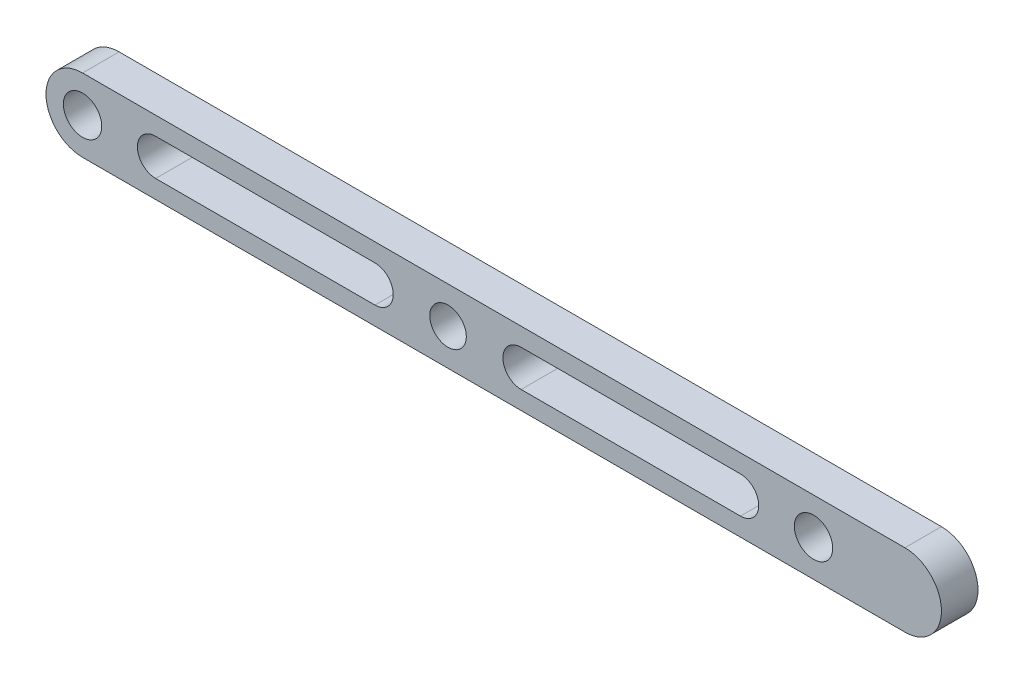
ISO-10303-21;
HEADER;
FILE_DESCRIPTION(('STEP AP214'),'2;1');
FILE_NAME('part.step','',(''),(''),'','','');
FILE_SCHEMA(('AUTOMOTIVE_DESIGN { 1 0 10303 214 1 1 1 1 }'));
ENDSEC;
DATA;
#1=APPLICATION_CONTEXT('core data for automotive mechanical design processes');
#2=APPLICATION_PROTOCOL_DEFINITION('international standard','automotive_design',2000,#1);
#3=PRODUCT_CONTEXT('',#1,'mechanical');
#4=PRODUCT('Part','Part','',(#3));
#5=PRODUCT_RELATED_PRODUCT_CATEGORY('part','',(#4));
#6=PRODUCT_DEFINITION_FORMATION('','',#4);
#7=PRODUCT_DEFINITION_CONTEXT('part definition',#1,'design');
#8=PRODUCT_DEFINITION('design','',#6,#7);
#9=PRODUCT_DEFINITION_SHAPE('','',#8);
#10=(LENGTH_UNIT() NAMED_UNIT(*) SI_UNIT(.MILLI.,.METRE.));
#11=(NAMED_UNIT(*) PLANE_ANGLE_UNIT() SI_UNIT($,.RADIAN.));
#12=(NAMED_UNIT(*) SI_UNIT($,.STERADIAN.) SOLID_ANGLE_UNIT());
#13=UNCERTAINTY_MEASURE_WITH_UNIT(LENGTH_MEASURE(1.E-05),#10,'distance_accuracy_value','');
#14=(GEOMETRIC_REPRESENTATION_CONTEXT(3) GLOBAL_UNCERTAINTY_ASSIGNED_CONTEXT((#13)) GLOBAL_UNIT_ASSIGNED_CONTEXT((#10,
#11,#12)) REPRESENTATION_CONTEXT('',''));
#15=CARTESIAN_POINT('',(0.,0.,0.));
#16=DIRECTION('',(0.,0.,1.));
#17=DIRECTION('',(1.,0.,0.));
#18=AXIS2_PLACEMENT_3D('',#15,#16,#17);
#19=CARTESIAN_POINT('',(124.999999999805,0.,10.));
#20=DIRECTION('',(0.,0.,1.));
#21=DIRECTION('',(1.,0.,0.));
#22=AXIS2_PLACEMENT_3D('',#19,#20,#21);
#23=PLANE('',#22);
#24=CARTESIAN_POINT('',(20.,0.,10.));
#25=DIRECTION('',(0.,0.,1.));
#26=DIRECTION('',(1.,0.,0.));
#27=AXIS2_PLACEMENT_3D('',#24,#25,#26);
#28=CIRCLE('',#27,5.);
#29=CARTESIAN_POINT('',(20.,5.,10.));
#30=VERTEX_POINT('',#29);
#31=CARTESIAN_POINT('',(20.,-5.,10.));
#32=VERTEX_POINT('',#31);
#33=EDGE_CURVE('E47',#30,#32,#28,.T.);
#34=ORIENTED_EDGE('',*,*,#33,.F.);
#35=DIRECTION('',(-1.,0.,0.));
#36=VECTOR('',#35,1.);
#37=CARTESIAN_POINT('',(20.,5.,10.));
#38=LINE('',#37,#36);
#39=CARTESIAN_POINT('',(79.999999999805,5.,10.));
#40=VERTEX_POINT('',#39);
#41=EDGE_CURVE('E139',#40,#30,#38,.T.);
#42=ORIENTED_EDGE('',*,*,#41,.F.);
#43=CARTESIAN_POINT('',(79.999999999805,0.,10.));
#44=DIRECTION('',(0.,0.,1.));
#45=DIRECTION('',(1.,0.,0.));
#46=AXIS2_PLACEMENT_3D('',#43,#44,#45);
#47=CIRCLE('',#46,5.);
#48=CARTESIAN_POINT('',(79.999999999805,-5.,10.));
#49=VERTEX_POINT('',#48);
#50=EDGE_CURVE('E142',#49,#40,#47,.T.);
#51=ORIENTED_EDGE('',*,*,#50,.F.);
#52=DIRECTION('',(1.,0.,0.));
#53=VECTOR('',#52,1.);
#54=CARTESIAN_POINT('',(20.,-5.,10.));
#55=LINE('',#54,#53);
#56=EDGE_CURVE('E148',#32,#49,#55,.T.);
#57=ORIENTED_EDGE('',*,*,#56,.F.);
#58=EDGE_LOOP('',(#34,#42,#51,#57));
#59=FACE_BOUND('',#58,.T.);
#60=CARTESIAN_POINT('',(-79.9999999999991,0.,10.));
#61=DIRECTION('',(0.,0.,1.));
#62=DIRECTION('',(1.,0.,0.));
#63=AXIS2_PLACEMENT_3D('',#60,#61,#62);
#64=CIRCLE('',#63,5.);
#65=CARTESIAN_POINT('',(-79.9999999999991,5.,10.));
#66=VERTEX_POINT('',#65);
#67=CARTESIAN_POINT('',(-79.9999999999991,-5.,10.));
#68=VERTEX_POINT('',#67);
#69=EDGE_CURVE('E154',#66,#68,#64,.T.);
#70=ORIENTED_EDGE('',*,*,#69,.F.);
#71=DIRECTION('',(-1.,0.,0.));
#72=VECTOR('',#71,1.);
#73=CARTESIAN_POINT('',(-79.9999999999991,5.,10.));
#74=LINE('',#73,#72);
#75=CARTESIAN_POINT('',(-20.,5.,10.));
#76=VERTEX_POINT('',#75);
#77=EDGE_CURVE('E162',#76,#66,#74,.T.);
#78=ORIENTED_EDGE('',*,*,#77,.F.);
#79=CARTESIAN_POINT('',(-20.,0.,10.));
#80=DIRECTION('',(0.,0.,1.));
#81=DIRECTION('',(1.,0.,0.));
#82=AXIS2_PLACEMENT_3D('',#79,#80,#81);
#83=CIRCLE('',#82,5.);
#84=CARTESIAN_POINT('',(-20.,-5.,10.));
#85=VERTEX_POINT('',#84);
#86=EDGE_CURVE('E176',#85,#76,#83,.T.);
#87=ORIENTED_EDGE('',*,*,#86,.F.);
#88=DIRECTION('',(1.,0.,0.));
#89=VECTOR('',#88,1.);
#90=CARTESIAN_POINT('',(-79.9999999999991,-5.,10.));
#91=LINE('',#90,#89);
#92=EDGE_CURVE('E173',#68,#85,#91,.T.);
#93=ORIENTED_EDGE('',*,*,#92,.F.);
#94=EDGE_LOOP('',(#70,#78,#87,#93));
#95=FACE_BOUND('',#94,.T.);
#96=CARTESIAN_POINT('',(0.,0.,10.));
#97=DIRECTION('',(0.,0.,1.));
#98=DIRECTION('',(1.,0.,0.));
#99=AXIS2_PLACEMENT_3D('',#96,#97,#98);
#100=CIRCLE('',#99,5.);
#101=CARTESIAN_POINT('',(5.,0.,10.));
#102=VERTEX_POINT('',#101);
#103=EDGE_CURVE('E183',#102,#102,#100,.T.);
#104=ORIENTED_EDGE('',*,*,#103,.F.);
#105=EDGE_LOOP('',(#104));
#106=FACE_BOUND('',#105,.T.);
#107=CARTESIAN_POINT('',(-99.9999999999991,0.,10.));
#108=DIRECTION('',(0.,0.,1.));
#109=DIRECTION('',(1.,0.,0.));
#110=AXIS2_PLACEMENT_3D('',#107,#108,#109);
#111=CIRCLE('',#110,5.25);
#112=CARTESIAN_POINT('',(-94.7499999999991,0.,10.));
#113=VERTEX_POINT('',#112);
#114=EDGE_CURVE('E202',#113,#113,#111,.T.);
#115=ORIENTED_EDGE('',*,*,#114,.F.);
#116=EDGE_LOOP('',(#115));
#117=FACE_BOUND('',#116,.T.);
#118=DIRECTION('',(1.,0.,0.));
#119=VECTOR('',#118,1.);
#120=CARTESIAN_POINT('',(99.999999999805,-10.,10.));
#121=LINE('',#120,#119);
#122=CARTESIAN_POINT('',(-99.9999999999991,-10.,10.));
#123=VERTEX_POINT('',#122);
#124=CARTESIAN_POINT('',(124.999999999805,-10.,10.));
#125=VERTEX_POINT('',#124);
#126=EDGE_CURVE('E208',#123,#125,#121,.T.);
#127=ORIENTED_EDGE('',*,*,#126,.T.);
#128=CARTESIAN_POINT('',(124.999999999805,0.,10.));
#129=DIRECTION('',(0.,0.,1.));
#130=DIRECTION('',(1.,0.,0.));
#131=AXIS2_PLACEMENT_3D('',#128,#129,#130);
#132=CIRCLE('',#131,10.);
#133=CARTESIAN_POINT('',(124.999999999805,10.,10.));
#134=VERTEX_POINT('',#133);
#135=EDGE_CURVE('E211',#125,#134,#132,.T.);
#136=ORIENTED_EDGE('',*,*,#135,.T.);
#137=DIRECTION('',(-1.,0.,0.));
#138=VECTOR('',#137,1.);
#139=CARTESIAN_POINT('',(100.000000000001,10.,10.));
#140=LINE('',#139,#138);
#141=CARTESIAN_POINT('',(-99.9999999999991,10.,10.));
#142=VERTEX_POINT('',#141);
#143=EDGE_CURVE('E214',#134,#142,#140,.T.);
#144=ORIENTED_EDGE('',*,*,#143,.T.);
#145=CARTESIAN_POINT('',(-99.9999999999991,0.,10.));
#146=DIRECTION('',(0.,0.,1.));
#147=DIRECTION('',(1.,0.,0.));
#148=AXIS2_PLACEMENT_3D('',#145,#146,#147);
#149=CIRCLE('',#148,10.);
#150=EDGE_CURVE('E216',#142,#123,#149,.T.);
#151=ORIENTED_EDGE('',*,*,#150,.T.);
#152=EDGE_LOOP('',(#127,#136,#144,#151));
#153=FACE_BOUND('',#152,.T.);
#154=CARTESIAN_POINT('',(99.999999999805,0.,10.));
#155=DIRECTION('',(0.,0.,1.));
#156=DIRECTION('',(1.,0.,0.));
#157=AXIS2_PLACEMENT_3D('',#154,#155,#156);
#158=CIRCLE('',#157,5.25);
#159=CARTESIAN_POINT('',(105.249999999805,0.,10.));
#160=VERTEX_POINT('',#159);
#161=EDGE_CURVE('E196',#160,#160,#158,.T.);
#162=ORIENTED_EDGE('',*,*,#161,.F.);
#163=EDGE_LOOP('',(#162));
#164=FACE_BOUND('',#163,.T.);
#165=ADVANCED_FACE('F32',(#59,#95,#106,#117,#153,#164),#23,.T.);
#166=CARTESIAN_POINT('',(124.999999999805,0.,0.));
#167=DIRECTION('',(0.,0.,1.));
#168=DIRECTION('',(1.,0.,0.));
#169=AXIS2_PLACEMENT_3D('',#166,#167,#168);
#170=PLANE('',#169);
#171=DIRECTION('',(-1.,0.,0.));
#172=VECTOR('',#171,1.);
#173=CARTESIAN_POINT('',(20.,5.,0.));
#174=LINE('',#173,#172);
#175=CARTESIAN_POINT('',(79.999999999805,5.,0.));
#176=VERTEX_POINT('',#175);
#177=CARTESIAN_POINT('',(20.,5.,0.));
#178=VERTEX_POINT('',#177);
#179=EDGE_CURVE('E129',#176,#178,#174,.T.);
#180=ORIENTED_EDGE('',*,*,#179,.T.);
#181=CARTESIAN_POINT('',(20.,0.,0.));
#182=DIRECTION('',(0.,0.,1.));
#183=DIRECTION('',(1.,0.,0.));
#184=AXIS2_PLACEMENT_3D('',#181,#182,#183);
#185=CIRCLE('',#184,5.);
#186=CARTESIAN_POINT('',(20.,-5.,0.));
#187=VERTEX_POINT('',#186);
#188=EDGE_CURVE('E123',#178,#187,#185,.T.);
#189=ORIENTED_EDGE('',*,*,#188,.T.);
#190=DIRECTION('',(1.,0.,0.));
#191=VECTOR('',#190,1.);
#192=CARTESIAN_POINT('',(20.,-5.,0.));
#193=LINE('',#192,#191);
#194=CARTESIAN_POINT('',(79.999999999805,-5.,0.));
#195=VERTEX_POINT('',#194);
#196=EDGE_CURVE('E132',#187,#195,#193,.T.);
#197=ORIENTED_EDGE('',*,*,#196,.T.);
#198=CARTESIAN_POINT('',(79.999999999805,0.,0.));
#199=DIRECTION('',(0.,0.,1.));
#200=DIRECTION('',(1.,0.,0.));
#201=AXIS2_PLACEMENT_3D('',#198,#199,#200);
#202=CIRCLE('',#201,5.);
#203=EDGE_CURVE('E55',#195,#176,#202,.T.);
#204=ORIENTED_EDGE('',*,*,#203,.T.);
#205=EDGE_LOOP('',(#180,#189,#197,#204));
#206=FACE_BOUND('',#205,.T.);
#207=DIRECTION('',(-1.,0.,0.));
#208=VECTOR('',#207,1.);
#209=CARTESIAN_POINT('',(-79.9999999999991,5.,0.));
#210=LINE('',#209,#208);
#211=CARTESIAN_POINT('',(-20.,5.,0.));
#212=VERTEX_POINT('',#211);
#213=CARTESIAN_POINT('',(-79.9999999999991,5.,0.));
#214=VERTEX_POINT('',#213);
#215=EDGE_CURVE('E168',#212,#214,#210,.T.);
#216=ORIENTED_EDGE('',*,*,#215,.T.);
#217=CARTESIAN_POINT('',(-79.9999999999991,0.,0.));
#218=DIRECTION('',(0.,0.,1.));
#219=DIRECTION('',(1.,0.,0.));
#220=AXIS2_PLACEMENT_3D('',#217,#218,#219);
#221=CIRCLE('',#220,5.);
#222=CARTESIAN_POINT('',(-79.9999999999991,-5.,0.));
#223=VERTEX_POINT('',#222);
#224=EDGE_CURVE('E158',#214,#223,#221,.T.);
#225=ORIENTED_EDGE('',*,*,#224,.T.);
#226=DIRECTION('',(1.,0.,0.));
#227=VECTOR('',#226,1.);
#228=CARTESIAN_POINT('',(-79.9999999999991,-5.,0.));
#229=LINE('',#228,#227);
#230=CARTESIAN_POINT('',(-20.,-5.,0.));
#231=VERTEX_POINT('',#230);
#232=EDGE_CURVE('E161',#223,#231,#229,.T.);
#233=ORIENTED_EDGE('',*,*,#232,.T.);
#234=CARTESIAN_POINT('',(-20.,0.,0.));
#235=DIRECTION('',(0.,0.,1.));
#236=DIRECTION('',(1.,0.,0.));
#237=AXIS2_PLACEMENT_3D('',#234,#235,#236);
#238=CIRCLE('',#237,5.);
#239=EDGE_CURVE('E165',#231,#212,#238,.T.);
#240=ORIENTED_EDGE('',*,*,#239,.T.);
#241=EDGE_LOOP('',(#216,#225,#233,#240));
#242=FACE_BOUND('',#241,.T.);
#243=CARTESIAN_POINT('',(0.,0.,0.));
#244=DIRECTION('',(0.,0.,1.));
#245=DIRECTION('',(1.,0.,0.));
#246=AXIS2_PLACEMENT_3D('',#243,#244,#245);
#247=CIRCLE('',#246,5.);
#248=CARTESIAN_POINT('',(5.,0.,0.));
#249=VERTEX_POINT('',#248);
#250=EDGE_CURVE('E190',#249,#249,#247,.T.);
#251=ORIENTED_EDGE('',*,*,#250,.T.);
#252=EDGE_LOOP('',(#251));
#253=FACE_BOUND('',#252,.T.);
#254=CARTESIAN_POINT('',(124.999999999805,0.,0.));
#255=DIRECTION('',(0.,0.,1.));
#256=DIRECTION('',(1.,0.,0.));
#257=AXIS2_PLACEMENT_3D('',#254,#255,#256);
#258=CIRCLE('',#257,10.);
#259=CARTESIAN_POINT('',(124.999999999805,-10.,0.));
#260=VERTEX_POINT('',#259);
#261=CARTESIAN_POINT('',(124.999999999805,10.,0.));
#262=VERTEX_POINT('',#261);
#263=EDGE_CURVE('E205',#260,#262,#258,.T.);
#264=ORIENTED_EDGE('',*,*,#263,.F.);
#265=DIRECTION('',(1.,0.,0.));
#266=VECTOR('',#265,1.);
#267=CARTESIAN_POINT('',(-99.9999999999991,-10.,0.));
#268=LINE('',#267,#266);
#269=CARTESIAN_POINT('',(-99.9999999999991,-10.,0.));
#270=VERTEX_POINT('',#269);
#271=EDGE_CURVE('E212',#270,#260,#268,.T.);
#272=ORIENTED_EDGE('',*,*,#271,.F.);
#273=CARTESIAN_POINT('',(-99.9999999999991,0.,0.));
#274=DIRECTION('',(0.,0.,1.));
#275=DIRECTION('',(1.,0.,0.));
#276=AXIS2_PLACEMENT_3D('',#273,#274,#275);
#277=CIRCLE('',#276,10.);
#278=CARTESIAN_POINT('',(-99.9999999999991,10.,0.));
#279=VERTEX_POINT('',#278);
#280=EDGE_CURVE('E224',#279,#270,#277,.T.);
#281=ORIENTED_EDGE('',*,*,#280,.F.);
#282=DIRECTION('',(-1.,0.,0.));
#283=VECTOR('',#282,1.);
#284=CARTESIAN_POINT('',(-99.9999999999991,10.,0.));
#285=LINE('',#284,#283);
#286=EDGE_CURVE('E222',#262,#279,#285,.T.);
#287=ORIENTED_EDGE('',*,*,#286,.F.);
#288=EDGE_LOOP('',(#264,#272,#281,#287));
#289=FACE_BOUND('',#288,.T.);
#290=CARTESIAN_POINT('',(-99.9999999999991,0.,0.));
#291=DIRECTION('',(0.,0.,1.));
#292=DIRECTION('',(1.,0.,0.));
#293=AXIS2_PLACEMENT_3D('',#290,#291,#292);
#294=CIRCLE('',#293,5.25);
#295=CARTESIAN_POINT('',(-94.7499999999991,0.,0.));
#296=VERTEX_POINT('',#295);
#297=EDGE_CURVE('E199',#296,#296,#294,.T.);
#298=ORIENTED_EDGE('',*,*,#297,.T.);
#299=EDGE_LOOP('',(#298));
#300=FACE_BOUND('',#299,.T.);
#301=CARTESIAN_POINT('',(99.999999999805,0.,0.));
#302=DIRECTION('',(0.,0.,1.));
#303=DIRECTION('',(1.,0.,0.));
#304=AXIS2_PLACEMENT_3D('',#301,#302,#303);
#305=CIRCLE('',#304,5.25);
#306=CARTESIAN_POINT('',(105.249999999805,0.,0.));
#307=VERTEX_POINT('',#306);
#308=EDGE_CURVE('E193',#307,#307,#305,.T.);
#309=ORIENTED_EDGE('',*,*,#308,.T.);
#310=EDGE_LOOP('',(#309));
#311=FACE_BOUND('',#310,.T.);
#312=ADVANCED_FACE('F136',(#206,#242,#253,#289,#300,#311),#170,.F.);
#313=CARTESIAN_POINT('',(124.999999999805,0.,10.));
#314=DIRECTION('',(0.,0.,-1.));
#315=DIRECTION('',(-1.,0.,0.));
#316=AXIS2_PLACEMENT_3D('',#313,#314,#315);
#317=CYLINDRICAL_SURFACE('',#316,10.);
#318=ORIENTED_EDGE('',*,*,#263,.T.);
#319=DIRECTION('',(0.,0.,-1.));
#320=VECTOR('',#319,1.);
#321=CARTESIAN_POINT('',(124.999999999805,10.,10.));
#322=LINE('',#321,#320);
#323=EDGE_CURVE('E40',#134,#262,#322,.T.);
#324=ORIENTED_EDGE('',*,*,#323,.F.);
#325=ORIENTED_EDGE('',*,*,#135,.F.);
#326=DIRECTION('',(0.,0.,-1.));
#327=VECTOR('',#326,1.);
#328=CARTESIAN_POINT('',(124.999999999805,-10.,10.));
#329=LINE('',#328,#327);
#330=EDGE_CURVE('E11',#125,#260,#329,.T.);
#331=ORIENTED_EDGE('',*,*,#330,.T.);
#332=EDGE_LOOP('',(#318,#324,#325,#331));
#333=FACE_BOUND('',#332,.T.);
#334=ADVANCED_FACE('F34',(#333),#317,.T.);
#335=CARTESIAN_POINT('',(-99.9999999999991,10.,10.));
#336=DIRECTION('',(0.,-1.,0.));
#337=DIRECTION('',(0.,0.,-1.));
#338=AXIS2_PLACEMENT_3D('',#335,#336,#337);
#339=PLANE('',#338);
#340=ORIENTED_EDGE('',*,*,#286,.T.);
#341=DIRECTION('',(0.,0.,-1.));
#342=VECTOR('',#341,1.);
#343=CARTESIAN_POINT('',(-99.9999999999991,10.,10.));
#344=LINE('',#343,#342);
#345=EDGE_CURVE('E229',#142,#279,#344,.T.);
#346=ORIENTED_EDGE('',*,*,#345,.F.);
#347=ORIENTED_EDGE('',*,*,#143,.F.);
#348=ORIENTED_EDGE('',*,*,#323,.T.);
#349=EDGE_LOOP('',(#340,#346,#347,#348));
#350=FACE_BOUND('',#349,.T.);
#351=ADVANCED_FACE('F235',(#350),#339,.F.);
#352=CARTESIAN_POINT('',(-99.9999999999991,0.,10.));
#353=DIRECTION('',(0.,0.,-1.));
#354=DIRECTION('',(-1.,0.,0.));
#355=AXIS2_PLACEMENT_3D('',#352,#353,#354);
#356=CYLINDRICAL_SURFACE('',#355,10.);
#357=ORIENTED_EDGE('',*,*,#280,.T.);
#358=DIRECTION('',(0.,0.,-1.));
#359=VECTOR('',#358,1.);
#360=CARTESIAN_POINT('',(-99.9999999999991,-10.,10.));
#361=LINE('',#360,#359);
#362=EDGE_CURVE('E219',#123,#270,#361,.T.);
#363=ORIENTED_EDGE('',*,*,#362,.F.);
#364=ORIENTED_EDGE('',*,*,#150,.F.);
#365=ORIENTED_EDGE('',*,*,#345,.T.);
#366=EDGE_LOOP('',(#357,#363,#364,#365));
#367=FACE_BOUND('',#366,.T.);
#368=ADVANCED_FACE('F246',(#367),#356,.T.);
#369=CARTESIAN_POINT('',(-99.9999999999991,-10.,10.));
#370=DIRECTION('',(0.,1.,0.));
#371=DIRECTION('',(-1.,0.,0.));
#372=AXIS2_PLACEMENT_3D('',#369,#370,#371);
#373=PLANE('',#372);
#374=ORIENTED_EDGE('',*,*,#271,.T.);
#375=ORIENTED_EDGE('',*,*,#330,.F.);
#376=ORIENTED_EDGE('',*,*,#126,.F.);
#377=ORIENTED_EDGE('',*,*,#362,.T.);
#378=EDGE_LOOP('',(#374,#375,#376,#377));
#379=FACE_BOUND('',#378,.T.);
#380=ADVANCED_FACE('F249',(#379),#373,.F.);
#381=CARTESIAN_POINT('',(-99.9999999999991,0.,10.));
#382=DIRECTION('',(0.,0.,-1.));
#383=DIRECTION('',(-1.,0.,0.));
#384=AXIS2_PLACEMENT_3D('',#381,#382,#383);
#385=CYLINDRICAL_SURFACE('',#384,5.25);
#386=ORIENTED_EDGE('',*,*,#114,.T.);
#387=EDGE_LOOP('',(#386));
#388=FACE_BOUND('',#387,.T.);
#389=ORIENTED_EDGE('',*,*,#297,.F.);
#390=EDGE_LOOP('',(#389));
#391=FACE_BOUND('',#390,.T.);
#392=ADVANCED_FACE('F261',(#388,#391),#385,.F.);
#393=CARTESIAN_POINT('',(99.999999999805,0.,10.));
#394=DIRECTION('',(0.,0.,-1.));
#395=DIRECTION('',(-1.,0.,0.));
#396=AXIS2_PLACEMENT_3D('',#393,#394,#395);
#397=CYLINDRICAL_SURFACE('',#396,5.25);
#398=ORIENTED_EDGE('',*,*,#161,.T.);
#399=EDGE_LOOP('',(#398));
#400=FACE_BOUND('',#399,.T.);
#401=ORIENTED_EDGE('',*,*,#308,.F.);
#402=EDGE_LOOP('',(#401));
#403=FACE_BOUND('',#402,.T.);
#404=ADVANCED_FACE('F257',(#400,#403),#397,.F.);
#405=CARTESIAN_POINT('',(0.,0.,0.));
#406=DIRECTION('',(0.,0.,1.));
#407=DIRECTION('',(1.,0.,0.));
#408=AXIS2_PLACEMENT_3D('',#405,#406,#407);
#409=CYLINDRICAL_SURFACE('',#408,5.);
#410=ORIENTED_EDGE('',*,*,#250,.F.);
#411=EDGE_LOOP('',(#410));
#412=FACE_BOUND('',#411,.T.);
#413=ORIENTED_EDGE('',*,*,#103,.T.);
#414=EDGE_LOOP('',(#413));
#415=FACE_BOUND('',#414,.T.);
#416=ADVANCED_FACE('F260',(#412,#415),#409,.F.);
#417=CARTESIAN_POINT('',(-79.9999999999991,0.,0.));
#418=DIRECTION('',(0.,0.,1.));
#419=DIRECTION('',(1.,0.,0.));
#420=AXIS2_PLACEMENT_3D('',#417,#418,#419);
#421=CYLINDRICAL_SURFACE('',#420,5.);
#422=ORIENTED_EDGE('',*,*,#69,.T.);
#423=DIRECTION('',(0.,0.,1.));
#424=VECTOR('',#423,1.);
#425=CARTESIAN_POINT('',(-79.9999999999991,-5.,0.));
#426=LINE('',#425,#424);
#427=EDGE_CURVE('E171',#223,#68,#426,.T.);
#428=ORIENTED_EDGE('',*,*,#427,.F.);
#429=ORIENTED_EDGE('',*,*,#224,.F.);
#430=DIRECTION('',(0.,0.,1.));
#431=VECTOR('',#430,1.);
#432=CARTESIAN_POINT('',(-79.9999999999991,5.,0.));
#433=LINE('',#432,#431);
#434=EDGE_CURVE('E181',#214,#66,#433,.T.);
#435=ORIENTED_EDGE('',*,*,#434,.T.);
#436=EDGE_LOOP('',(#422,#428,#429,#435));
#437=FACE_BOUND('',#436,.T.);
#438=ADVANCED_FACE('F304',(#437),#421,.F.);
#439=CARTESIAN_POINT('',(-79.9999999999991,5.,0.));
#440=DIRECTION('',(0.,1.,0.));
#441=DIRECTION('',(0.,0.,1.));
#442=AXIS2_PLACEMENT_3D('',#439,#440,#441);
#443=PLANE('',#442);
#444=ORIENTED_EDGE('',*,*,#77,.T.);
#445=ORIENTED_EDGE('',*,*,#434,.F.);
#446=ORIENTED_EDGE('',*,*,#215,.F.);
#447=DIRECTION('',(0.,0.,1.));
#448=VECTOR('',#447,1.);
#449=CARTESIAN_POINT('',(-20.,5.,0.));
#450=LINE('',#449,#448);
#451=EDGE_CURVE('E184',#212,#76,#450,.T.);
#452=ORIENTED_EDGE('',*,*,#451,.T.);
#453=EDGE_LOOP('',(#444,#445,#446,#452));
#454=FACE_BOUND('',#453,.T.);
#455=ADVANCED_FACE('F313',(#454),#443,.F.);
#456=CARTESIAN_POINT('',(-20.,0.,0.));
#457=DIRECTION('',(0.,0.,1.));
#458=DIRECTION('',(1.,0.,0.));
#459=AXIS2_PLACEMENT_3D('',#456,#457,#458);
#460=CYLINDRICAL_SURFACE('',#459,5.);
#461=ORIENTED_EDGE('',*,*,#86,.T.);
#462=ORIENTED_EDGE('',*,*,#451,.F.);
#463=ORIENTED_EDGE('',*,*,#239,.F.);
#464=DIRECTION('',(0.,0.,1.));
#465=VECTOR('',#464,1.);
#466=CARTESIAN_POINT('',(-20.,-5.,0.));
#467=LINE('',#466,#465);
#468=EDGE_CURVE('E186',#231,#85,#467,.T.);
#469=ORIENTED_EDGE('',*,*,#468,.T.);
#470=EDGE_LOOP('',(#461,#462,#463,#469));
#471=FACE_BOUND('',#470,.T.);
#472=ADVANCED_FACE('F321',(#471),#460,.F.);
#473=CARTESIAN_POINT('',(-79.9999999999991,-5.,0.));
#474=DIRECTION('',(0.,-1.,0.));
#475=DIRECTION('',(0.,0.,-1.));
#476=AXIS2_PLACEMENT_3D('',#473,#474,#475);
#477=PLANE('',#476);
#478=ORIENTED_EDGE('',*,*,#92,.T.);
#479=ORIENTED_EDGE('',*,*,#468,.F.);
#480=ORIENTED_EDGE('',*,*,#232,.F.);
#481=ORIENTED_EDGE('',*,*,#427,.T.);
#482=EDGE_LOOP('',(#478,#479,#480,#481));
#483=FACE_BOUND('',#482,.T.);
#484=ADVANCED_FACE('F329',(#483),#477,.F.);
#485=CARTESIAN_POINT('',(20.,0.,0.));
#486=DIRECTION('',(0.,0.,1.));
#487=DIRECTION('',(1.,0.,0.));
#488=AXIS2_PLACEMENT_3D('',#485,#486,#487);
#489=CYLINDRICAL_SURFACE('',#488,5.);
#490=ORIENTED_EDGE('',*,*,#33,.T.);
#491=DIRECTION('',(0.,0.,1.));
#492=VECTOR('',#491,1.);
#493=CARTESIAN_POINT('',(20.,-5.,0.));
#494=LINE('',#493,#492);
#495=EDGE_CURVE('E119',#187,#32,#494,.T.);
#496=ORIENTED_EDGE('',*,*,#495,.F.);
#497=ORIENTED_EDGE('',*,*,#188,.F.);
#498=DIRECTION('',(0.,0.,1.));
#499=VECTOR('',#498,1.);
#500=CARTESIAN_POINT('',(20.,5.,0.));
#501=LINE('',#500,#499);
#502=EDGE_CURVE('E152',#178,#30,#501,.T.);
#503=ORIENTED_EDGE('',*,*,#502,.T.);
#504=EDGE_LOOP('',(#490,#496,#497,#503));
#505=FACE_BOUND('',#504,.T.);
#506=ADVANCED_FACE('F121',(#505),#489,.F.);
#507=CARTESIAN_POINT('',(20.,5.,0.));
#508=DIRECTION('',(0.,1.,0.));
#509=DIRECTION('',(0.,0.,1.));
#510=AXIS2_PLACEMENT_3D('',#507,#508,#509);
#511=PLANE('',#510);
#512=ORIENTED_EDGE('',*,*,#41,.T.);
#513=ORIENTED_EDGE('',*,*,#502,.F.);
#514=ORIENTED_EDGE('',*,*,#179,.F.);
#515=DIRECTION('',(0.,0.,1.));
#516=VECTOR('',#515,1.);
#517=CARTESIAN_POINT('',(79.999999999805,5.,0.));
#518=LINE('',#517,#516);
#519=EDGE_CURVE('E155',#176,#40,#518,.T.);
#520=ORIENTED_EDGE('',*,*,#519,.T.);
#521=EDGE_LOOP('',(#512,#513,#514,#520));
#522=FACE_BOUND('',#521,.T.);
#523=ADVANCED_FACE('F344',(#522),#511,.F.);
#524=CARTESIAN_POINT('',(79.999999999805,0.,0.));
#525=DIRECTION('',(0.,0.,1.));
#526=DIRECTION('',(1.,0.,0.));
#527=AXIS2_PLACEMENT_3D('',#524,#525,#526);
#528=CYLINDRICAL_SURFACE('',#527,5.);
#529=ORIENTED_EDGE('',*,*,#50,.T.);
#530=ORIENTED_EDGE('',*,*,#519,.F.);
#531=ORIENTED_EDGE('',*,*,#203,.F.);
#532=DIRECTION('',(0.,0.,1.));
#533=VECTOR('',#532,1.);
#534=CARTESIAN_POINT('',(79.999999999805,-5.,0.));
#535=LINE('',#534,#533);
#536=EDGE_CURVE('E128',#195,#49,#535,.T.);
#537=ORIENTED_EDGE('',*,*,#536,.T.);
#538=EDGE_LOOP('',(#529,#530,#531,#537));
#539=FACE_BOUND('',#538,.T.);
#540=ADVANCED_FACE('F351',(#539),#528,.F.);
#541=CARTESIAN_POINT('',(20.,-5.,0.));
#542=DIRECTION('',(0.,-1.,0.));
#543=DIRECTION('',(0.,0.,-1.));
#544=AXIS2_PLACEMENT_3D('',#541,#542,#543);
#545=PLANE('',#544);
#546=ORIENTED_EDGE('',*,*,#56,.T.);
#547=ORIENTED_EDGE('',*,*,#536,.F.);
#548=ORIENTED_EDGE('',*,*,#196,.F.);
#549=ORIENTED_EDGE('',*,*,#495,.T.);
#550=EDGE_LOOP('',(#546,#547,#548,#549));
#551=FACE_BOUND('',#550,.T.);
#552=ADVANCED_FACE('F133',(#551),#545,.F.);
#553=CLOSED_SHELL('',(#165,#312,#334,#351,#368,#380,#392,#404,#416,#438,#455,#472,#484,#506,
#523,#540,#552));
#554=MANIFOLD_SOLID_BREP('B2',#553);
#555=ADVANCED_BREP_SHAPE_REPRESENTATION('',(#18,#554),#14);
#556=SHAPE_DEFINITION_REPRESENTATION(#9,#555);
ENDSEC;
END-ISO-10303-21;
